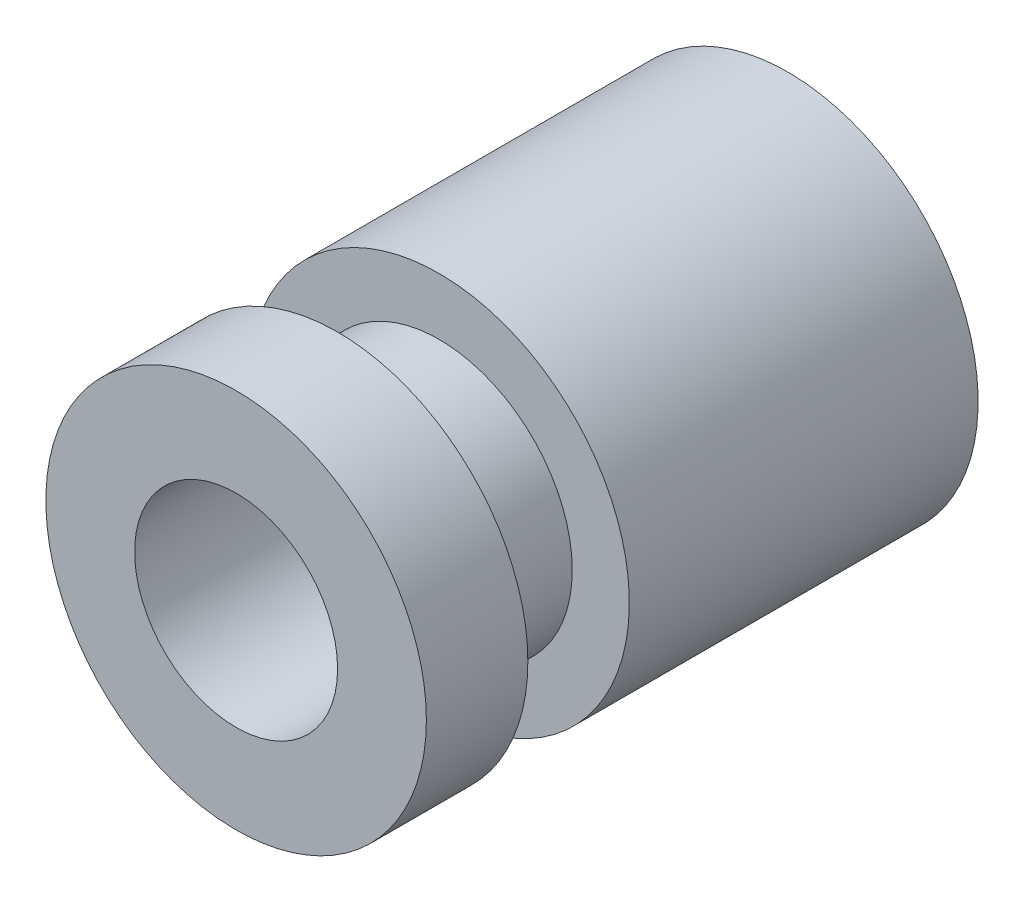
ISO-10303-21;
HEADER;
FILE_DESCRIPTION(('STEP AP214'),'2;1');
FILE_NAME('part.step','',(''),(''),'','','');
FILE_SCHEMA(('AUTOMOTIVE_DESIGN { 1 0 10303 214 1 1 1 1 }'));
ENDSEC;
DATA;
#1=APPLICATION_CONTEXT('core data for automotive mechanical design processes');
#2=APPLICATION_PROTOCOL_DEFINITION('international standard','automotive_design',2000,#1);
#3=PRODUCT_CONTEXT('',#1,'mechanical');
#4=PRODUCT('Part','Part','',(#3));
#5=PRODUCT_RELATED_PRODUCT_CATEGORY('part','',(#4));
#6=PRODUCT_DEFINITION_FORMATION('','',#4);
#7=PRODUCT_DEFINITION_CONTEXT('part definition',#1,'design');
#8=PRODUCT_DEFINITION('design','',#6,#7);
#9=PRODUCT_DEFINITION_SHAPE('','',#8);
#10=(LENGTH_UNIT() NAMED_UNIT(*) SI_UNIT(.MILLI.,.METRE.));
#11=(NAMED_UNIT(*) PLANE_ANGLE_UNIT() SI_UNIT($,.RADIAN.));
#12=(NAMED_UNIT(*) SI_UNIT($,.STERADIAN.) SOLID_ANGLE_UNIT());
#13=UNCERTAINTY_MEASURE_WITH_UNIT(LENGTH_MEASURE(1.E-05),#10,'distance_accuracy_value','');
#14=(GEOMETRIC_REPRESENTATION_CONTEXT(3) GLOBAL_UNCERTAINTY_ASSIGNED_CONTEXT((#13)) GLOBAL_UNIT_ASSIGNED_CONTEXT((#10,
#11,#12)) REPRESENTATION_CONTEXT('',''));
#15=CARTESIAN_POINT('',(0.,0.,0.));
#16=DIRECTION('',(0.,0.,1.));
#17=DIRECTION('',(1.,0.,0.));
#18=AXIS2_PLACEMENT_3D('',#15,#16,#17);
#19=CARTESIAN_POINT('',(-15.25,-15.25,1.6));
#20=DIRECTION('',(0.,0.,1.));
#21=DIRECTION('',(1.,0.,0.));
#22=AXIS2_PLACEMENT_3D('',#19,#20,#21);
#23=PLANE('',#22);
#24=CARTESIAN_POINT('',(-15.25,-15.25,1.6));
#25=DIRECTION('',(0.,0.,1.));
#26=DIRECTION('',(1.,0.,0.));
#27=AXIS2_PLACEMENT_3D('',#24,#25,#26);
#28=CIRCLE('',#27,2.1);
#29=CARTESIAN_POINT('',(-17.35,-15.25,1.6));
#30=VERTEX_POINT('',#29);
#31=EDGE_CURVE('E91',#30,#30,#28,.T.);
#32=ORIENTED_EDGE('',*,*,#31,.T.);
#33=EDGE_LOOP('',(#32));
#34=FACE_BOUND('',#33,.T.);
#35=CARTESIAN_POINT('',(-15.25,-15.25,1.6));
#36=DIRECTION('',(0.,0.,1.));
#37=DIRECTION('',(-1.,0.,0.));
#38=AXIS2_PLACEMENT_3D('',#35,#36,#37);
#39=CIRCLE('',#38,3.);
#40=CARTESIAN_POINT('',(-12.25,-15.25,1.6));
#41=VERTEX_POINT('',#40);
#42=EDGE_CURVE('E10',#41,#41,#39,.T.);
#43=ORIENTED_EDGE('',*,*,#42,.F.);
#44=EDGE_LOOP('',(#43));
#45=FACE_BOUND('',#44,.T.);
#46=ADVANCED_FACE('F16',(#34,#45),#23,.F.);
#47=CARTESIAN_POINT('',(-15.25,-15.25,3.2));
#48=DIRECTION('',(0.,0.,1.));
#49=DIRECTION('',(1.,0.,0.));
#50=AXIS2_PLACEMENT_3D('',#47,#48,#49);
#51=PLANE('',#50);
#52=CARTESIAN_POINT('',(-15.25,-15.25,3.2));
#53=DIRECTION('',(0.,0.,-1.));
#54=DIRECTION('',(-1.,0.,0.));
#55=AXIS2_PLACEMENT_3D('',#52,#53,#54);
#56=CIRCLE('',#55,1.6);
#57=CARTESIAN_POINT('',(-13.65,-15.25,3.2));
#58=VERTEX_POINT('',#57);
#59=EDGE_CURVE('E92',#58,#58,#56,.T.);
#60=ORIENTED_EDGE('',*,*,#59,.T.);
#61=EDGE_LOOP('',(#60));
#62=FACE_BOUND('',#61,.T.);
#63=CARTESIAN_POINT('',(-15.25,-15.25,3.2));
#64=DIRECTION('',(0.,0.,1.));
#65=DIRECTION('',(-1.,0.,0.));
#66=AXIS2_PLACEMENT_3D('',#63,#64,#65);
#67=CIRCLE('',#66,3.);
#68=CARTESIAN_POINT('',(-12.25,-15.25,3.2));
#69=VERTEX_POINT('',#68);
#70=EDGE_CURVE('E19',#69,#69,#67,.T.);
#71=ORIENTED_EDGE('',*,*,#70,.T.);
#72=EDGE_LOOP('',(#71));
#73=FACE_BOUND('',#72,.T.);
#74=ADVANCED_FACE('F121',(#62,#73),#51,.T.);
#75=CARTESIAN_POINT('',(-15.25,-15.25,1.6));
#76=DIRECTION('',(0.,0.,1.));
#77=DIRECTION('',(-1.,0.,0.));
#78=AXIS2_PLACEMENT_3D('',#75,#76,#77);
#79=CYLINDRICAL_SURFACE('',#78,3.);
#80=ORIENTED_EDGE('',*,*,#70,.F.);
#81=DIRECTION('',(0.,0.,-1.));
#82=VECTOR('',#81,1.);
#83=CARTESIAN_POINT('',(-12.25,-15.25,1.6));
#84=LINE('',#83,#82);
#85=EDGE_CURVE('E25',#69,#41,#84,.T.);
#86=ORIENTED_EDGE('',*,*,#85,.T.);
#87=ORIENTED_EDGE('',*,*,#42,.T.);
#88=ORIENTED_EDGE('',*,*,#85,.F.);
#89=EDGE_LOOP('',(#80,#86,#87,#88));
#90=FACE_BOUND('',#89,.T.);
#91=ADVANCED_FACE('F122',(#90),#79,.T.);
#92=CARTESIAN_POINT('',(-15.25,-15.25,1.6));
#93=DIRECTION('',(0.,0.,1.));
#94=DIRECTION('',(-1.,0.,0.));
#95=AXIS2_PLACEMENT_3D('',#92,#93,#94);
#96=CYLINDRICAL_SURFACE('',#95,1.6);
#97=ORIENTED_EDGE('',*,*,#59,.F.);
#98=DIRECTION('',(0.,0.,-1.));
#99=VECTOR('',#98,1.);
#100=CARTESIAN_POINT('',(-13.65,-15.25,1.6));
#101=LINE('',#100,#99);
#102=CARTESIAN_POINT('',(-13.65,-15.25,-5.5));
#103=VERTEX_POINT('',#102);
#104=EDGE_CURVE('E95',#58,#103,#101,.T.);
#105=ORIENTED_EDGE('',*,*,#104,.T.);
#106=CARTESIAN_POINT('',(-15.25,-15.25,-5.5));
#107=DIRECTION('',(0.,0.,1.));
#108=DIRECTION('',(1.,0.,0.));
#109=AXIS2_PLACEMENT_3D('',#106,#107,#108);
#110=CIRCLE('',#109,1.6);
#111=EDGE_CURVE('E75',#103,#103,#110,.T.);
#112=ORIENTED_EDGE('',*,*,#111,.F.);
#113=ORIENTED_EDGE('',*,*,#104,.F.);
#114=EDGE_LOOP('',(#97,#105,#112,#113));
#115=FACE_BOUND('',#114,.T.);
#116=ADVANCED_FACE('F124',(#115),#96,.F.);
#117=CARTESIAN_POINT('',(-15.25,-15.25,1.6));
#118=DIRECTION('',(0.,0.,-1.));
#119=DIRECTION('',(1.,0.,0.));
#120=AXIS2_PLACEMENT_3D('',#117,#118,#119);
#121=CYLINDRICAL_SURFACE('',#120,2.1);
#122=CARTESIAN_POINT('',(-15.25,-15.25,0.));
#123=DIRECTION('',(0.,0.,-1.));
#124=DIRECTION('',(1.,0.,0.));
#125=AXIS2_PLACEMENT_3D('',#122,#123,#124);
#126=CIRCLE('',#125,2.1);
#127=CARTESIAN_POINT('',(-17.35,-15.25,0.));
#128=VERTEX_POINT('',#127);
#129=EDGE_CURVE('E85',#128,#128,#126,.T.);
#130=ORIENTED_EDGE('',*,*,#129,.F.);
#131=DIRECTION('',(0.,0.,1.));
#132=VECTOR('',#131,1.);
#133=CARTESIAN_POINT('',(-17.35,-15.25,1.6));
#134=LINE('',#133,#132);
#135=EDGE_CURVE('E83',#128,#30,#134,.T.);
#136=ORIENTED_EDGE('',*,*,#135,.T.);
#137=ORIENTED_EDGE('',*,*,#31,.F.);
#138=ORIENTED_EDGE('',*,*,#135,.F.);
#139=EDGE_LOOP('',(#130,#136,#137,#138));
#140=FACE_BOUND('',#139,.T.);
#141=ADVANCED_FACE('F131',(#140),#121,.T.);
#142=CARTESIAN_POINT('',(-15.25,-15.25,-5.5));
#143=DIRECTION('',(0.,0.,-1.));
#144=DIRECTION('',(0.,-1.,0.));
#145=AXIS2_PLACEMENT_3D('',#142,#143,#144);
#146=PLANE('',#145);
#147=ORIENTED_EDGE('',*,*,#111,.T.);
#148=EDGE_LOOP('',(#147));
#149=FACE_BOUND('',#148,.T.);
#150=CARTESIAN_POINT('',(-15.25,-15.25,-5.5));
#151=DIRECTION('',(0.,0.,-1.));
#152=DIRECTION('',(1.,0.,0.));
#153=AXIS2_PLACEMENT_3D('',#150,#151,#152);
#154=CIRCLE('',#153,3.);
#155=CARTESIAN_POINT('',(-18.25,-15.25,-5.5));
#156=VERTEX_POINT('',#155);
#157=EDGE_CURVE('E73',#156,#156,#154,.T.);
#158=ORIENTED_EDGE('',*,*,#157,.T.);
#159=EDGE_LOOP('',(#158));
#160=FACE_BOUND('',#159,.T.);
#161=ADVANCED_FACE('F172',(#149,#160),#146,.T.);
#162=CARTESIAN_POINT('',(-15.25,-15.25,0.));
#163=DIRECTION('',(0.,0.,-1.));
#164=DIRECTION('',(1.,0.,0.));
#165=AXIS2_PLACEMENT_3D('',#162,#163,#164);
#166=CYLINDRICAL_SURFACE('',#165,3.);
#167=ORIENTED_EDGE('',*,*,#157,.F.);
#168=DIRECTION('',(0.,0.,1.));
#169=VECTOR('',#168,1.);
#170=CARTESIAN_POINT('',(-18.25,-15.25,0.));
#171=LINE('',#170,#169);
#172=CARTESIAN_POINT('',(-18.25,-15.25,0.));
#173=VERTEX_POINT('',#172);
#174=EDGE_CURVE('E68',#156,#173,#171,.T.);
#175=ORIENTED_EDGE('',*,*,#174,.T.);
#176=CARTESIAN_POINT('',(-15.25,-15.25,0.));
#177=DIRECTION('',(0.,0.,-1.));
#178=DIRECTION('',(1.,0.,0.));
#179=AXIS2_PLACEMENT_3D('',#176,#177,#178);
#180=CIRCLE('',#179,3.);
#181=EDGE_CURVE('E71',#173,#173,#180,.T.);
#182=ORIENTED_EDGE('',*,*,#181,.T.);
#183=ORIENTED_EDGE('',*,*,#174,.F.);
#184=EDGE_LOOP('',(#167,#175,#182,#183));
#185=FACE_BOUND('',#184,.T.);
#186=ADVANCED_FACE('F69',(#185),#166,.T.);
#187=CARTESIAN_POINT('',(-15.25,-15.25,0.));
#188=DIRECTION('',(0.,0.,-1.));
#189=DIRECTION('',(0.,-1.,0.));
#190=AXIS2_PLACEMENT_3D('',#187,#188,#189);
#191=PLANE('',#190);
#192=ORIENTED_EDGE('',*,*,#129,.T.);
#193=EDGE_LOOP('',(#192));
#194=FACE_BOUND('',#193,.T.);
#195=ORIENTED_EDGE('',*,*,#181,.F.);
#196=EDGE_LOOP('',(#195));
#197=FACE_BOUND('',#196,.T.);
#198=ADVANCED_FACE('F193',(#194,#197),#191,.F.);
#199=CLOSED_SHELL('',(#46,#74,#91,#116,#141,#161,#186,#198));
#200=MANIFOLD_SOLID_BREP('B1',#199);
#201=ADVANCED_BREP_SHAPE_REPRESENTATION('',(#18,#200),#14);
#202=SHAPE_DEFINITION_REPRESENTATION(#9,#201);
ENDSEC;
END-ISO-10303-21;
